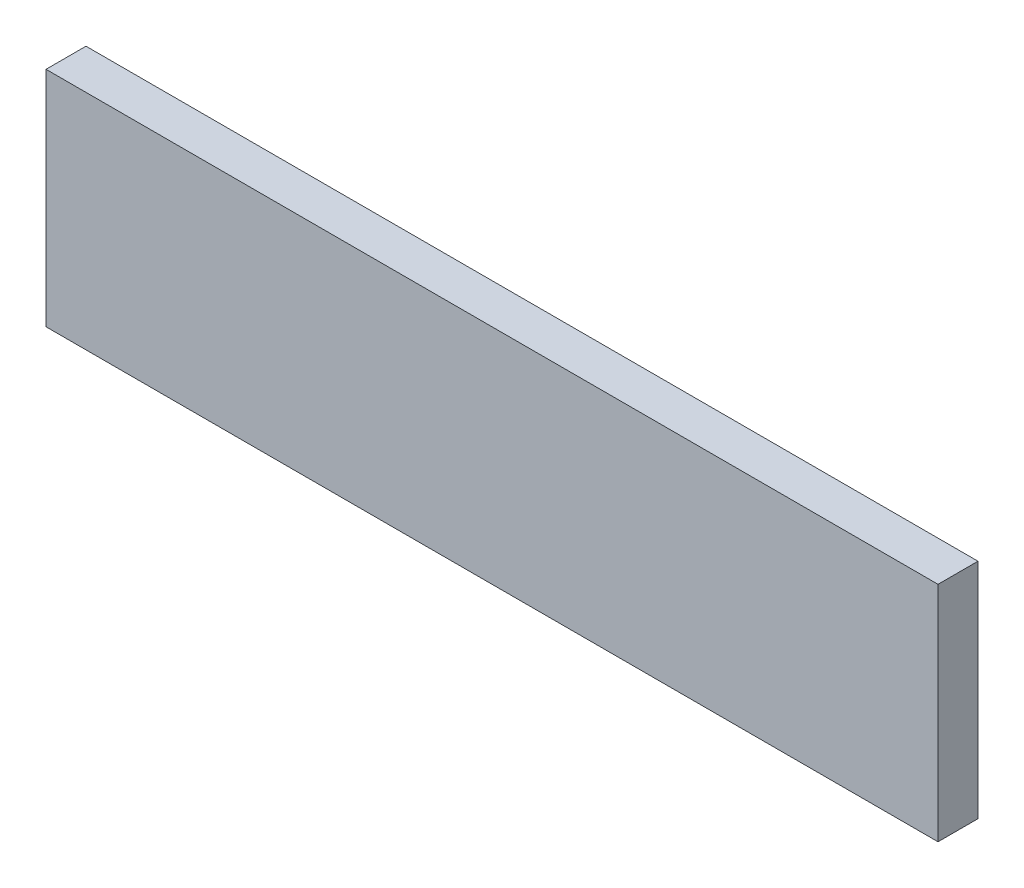
ISO-10303-21;
HEADER;
FILE_DESCRIPTION(('STEP AP214'),'2;1');
FILE_NAME('part.step','',(''),(''),'','','');
FILE_SCHEMA(('AUTOMOTIVE_DESIGN { 1 0 10303 214 1 1 1 1 }'));
ENDSEC;
DATA;
#1=APPLICATION_CONTEXT('core data for automotive mechanical design processes');
#2=APPLICATION_PROTOCOL_DEFINITION('international standard','automotive_design',2000,#1);
#3=PRODUCT_CONTEXT('',#1,'mechanical');
#4=PRODUCT('Part','Part','',(#3));
#5=PRODUCT_RELATED_PRODUCT_CATEGORY('part','',(#4));
#6=PRODUCT_DEFINITION_FORMATION('','',#4);
#7=PRODUCT_DEFINITION_CONTEXT('part definition',#1,'design');
#8=PRODUCT_DEFINITION('design','',#6,#7);
#9=PRODUCT_DEFINITION_SHAPE('','',#8);
#10=(LENGTH_UNIT() NAMED_UNIT(*) SI_UNIT(.MILLI.,.METRE.));
#11=(NAMED_UNIT(*) PLANE_ANGLE_UNIT() SI_UNIT($,.RADIAN.));
#12=(NAMED_UNIT(*) SI_UNIT($,.STERADIAN.) SOLID_ANGLE_UNIT());
#13=UNCERTAINTY_MEASURE_WITH_UNIT(LENGTH_MEASURE(1.E-05),#10,'distance_accuracy_value','');
#14=(GEOMETRIC_REPRESENTATION_CONTEXT(3) GLOBAL_UNCERTAINTY_ASSIGNED_CONTEXT((#13)) GLOBAL_UNIT_ASSIGNED_CONTEXT((#10,
#11,#12)) REPRESENTATION_CONTEXT('',''));
#15=CARTESIAN_POINT('',(0.,0.,0.));
#16=DIRECTION('',(0.,0.,1.));
#17=DIRECTION('',(1.,0.,0.));
#18=AXIS2_PLACEMENT_3D('',#15,#16,#17);
#19=CARTESIAN_POINT('',(34.,-8.5,3.048));
#20=DIRECTION('',(-1.,0.,0.));
#21=DIRECTION('',(0.,0.,1.));
#22=AXIS2_PLACEMENT_3D('',#19,#20,#21);
#23=PLANE('',#22);
#24=DIRECTION('',(0.,1.,0.));
#25=VECTOR('',#24,1.);
#26=CARTESIAN_POINT('',(34.,-8.5,0.));
#27=LINE('',#26,#25);
#28=CARTESIAN_POINT('',(34.,-8.5,0.));
#29=VERTEX_POINT('',#28);
#30=CARTESIAN_POINT('',(34.,8.5,0.));
#31=VERTEX_POINT('',#30);
#32=EDGE_CURVE('E96',#29,#31,#27,.T.);
#33=ORIENTED_EDGE('',*,*,#32,.T.);
#34=DIRECTION('',(0.,0.,-1.));
#35=VECTOR('',#34,1.);
#36=CARTESIAN_POINT('',(34.,8.5,3.048));
#37=LINE('',#36,#35);
#38=CARTESIAN_POINT('',(34.,8.5,3.048));
#39=VERTEX_POINT('',#38);
#40=EDGE_CURVE('E11',#39,#31,#37,.T.);
#41=ORIENTED_EDGE('',*,*,#40,.F.);
#42=DIRECTION('',(0.,1.,0.));
#43=VECTOR('',#42,1.);
#44=CARTESIAN_POINT('',(34.,-8.5,3.048));
#45=LINE('',#44,#43);
#46=CARTESIAN_POINT('',(34.,-8.5,3.048));
#47=VERTEX_POINT('',#46);
#48=EDGE_CURVE('E84',#47,#39,#45,.T.);
#49=ORIENTED_EDGE('',*,*,#48,.F.);
#50=DIRECTION('',(0.,0.,-1.));
#51=VECTOR('',#50,1.);
#52=CARTESIAN_POINT('',(34.,-8.5,3.048));
#53=LINE('',#52,#51);
#54=EDGE_CURVE('E92',#47,#29,#53,.T.);
#55=ORIENTED_EDGE('',*,*,#54,.T.);
#56=EDGE_LOOP('',(#33,#41,#49,#55));
#57=FACE_BOUND('',#56,.T.);
#58=ADVANCED_FACE('F33',(#57),#23,.F.);
#59=CARTESIAN_POINT('',(-34.,8.5,3.048));
#60=DIRECTION('',(0.,-1.,0.));
#61=DIRECTION('',(0.,0.,-1.));
#62=AXIS2_PLACEMENT_3D('',#59,#60,#61);
#63=PLANE('',#62);
#64=DIRECTION('',(-1.,0.,0.));
#65=VECTOR('',#64,1.);
#66=CARTESIAN_POINT('',(-34.,8.5,0.));
#67=LINE('',#66,#65);
#68=CARTESIAN_POINT('',(-34.,8.5,0.));
#69=VERTEX_POINT('',#68);
#70=EDGE_CURVE('E88',#31,#69,#67,.T.);
#71=ORIENTED_EDGE('',*,*,#70,.T.);
#72=DIRECTION('',(0.,0.,-1.));
#73=VECTOR('',#72,1.);
#74=CARTESIAN_POINT('',(-34.,8.5,3.048));
#75=LINE('',#74,#73);
#76=CARTESIAN_POINT('',(-34.,8.5,3.048));
#77=VERTEX_POINT('',#76);
#78=EDGE_CURVE('E41',#77,#69,#75,.T.);
#79=ORIENTED_EDGE('',*,*,#78,.F.);
#80=DIRECTION('',(-1.,0.,0.));
#81=VECTOR('',#80,1.);
#82=CARTESIAN_POINT('',(-34.,8.5,3.048));
#83=LINE('',#82,#81);
#84=EDGE_CURVE('E79',#39,#77,#83,.T.);
#85=ORIENTED_EDGE('',*,*,#84,.F.);
#86=ORIENTED_EDGE('',*,*,#40,.T.);
#87=EDGE_LOOP('',(#71,#79,#85,#86));
#88=FACE_BOUND('',#87,.T.);
#89=ADVANCED_FACE('F87',(#88),#63,.F.);
#90=CARTESIAN_POINT('',(-34.,-8.5,3.048));
#91=DIRECTION('',(1.,0.,0.));
#92=DIRECTION('',(0.,0.,-1.));
#93=AXIS2_PLACEMENT_3D('',#90,#91,#92);
#94=PLANE('',#93);
#95=DIRECTION('',(0.,-1.,0.));
#96=VECTOR('',#95,1.);
#97=CARTESIAN_POINT('',(-34.,-8.5,0.));
#98=LINE('',#97,#96);
#99=CARTESIAN_POINT('',(-34.,-8.5,0.));
#100=VERTEX_POINT('',#99);
#101=EDGE_CURVE('E66',#69,#100,#98,.T.);
#102=ORIENTED_EDGE('',*,*,#101,.T.);
#103=DIRECTION('',(0.,0.,-1.));
#104=VECTOR('',#103,1.);
#105=CARTESIAN_POINT('',(-34.,-8.5,3.048));
#106=LINE('',#105,#104);
#107=CARTESIAN_POINT('',(-34.,-8.5,3.048));
#108=VERTEX_POINT('',#107);
#109=EDGE_CURVE('E89',#108,#100,#106,.T.);
#110=ORIENTED_EDGE('',*,*,#109,.F.);
#111=DIRECTION('',(0.,-1.,0.));
#112=VECTOR('',#111,1.);
#113=CARTESIAN_POINT('',(-34.,-8.5,3.048));
#114=LINE('',#113,#112);
#115=EDGE_CURVE('E82',#77,#108,#114,.T.);
#116=ORIENTED_EDGE('',*,*,#115,.F.);
#117=ORIENTED_EDGE('',*,*,#78,.T.);
#118=EDGE_LOOP('',(#102,#110,#116,#117));
#119=FACE_BOUND('',#118,.T.);
#120=ADVANCED_FACE('F90',(#119),#94,.F.);
#121=CARTESIAN_POINT('',(-34.,-8.5,3.048));
#122=DIRECTION('',(0.,1.,0.));
#123=DIRECTION('',(0.,0.,1.));
#124=AXIS2_PLACEMENT_3D('',#121,#122,#123);
#125=PLANE('',#124);
#126=DIRECTION('',(1.,0.,0.));
#127=VECTOR('',#126,1.);
#128=CARTESIAN_POINT('',(-34.,-8.5,0.));
#129=LINE('',#128,#127);
#130=EDGE_CURVE('E72',#100,#29,#129,.T.);
#131=ORIENTED_EDGE('',*,*,#130,.T.);
#132=ORIENTED_EDGE('',*,*,#54,.F.);
#133=DIRECTION('',(1.,0.,0.));
#134=VECTOR('',#133,1.);
#135=CARTESIAN_POINT('',(-34.,-8.5,3.048));
#136=LINE('',#135,#134);
#137=EDGE_CURVE('E49',#108,#47,#136,.T.);
#138=ORIENTED_EDGE('',*,*,#137,.F.);
#139=ORIENTED_EDGE('',*,*,#109,.T.);
#140=EDGE_LOOP('',(#131,#132,#138,#139));
#141=FACE_BOUND('',#140,.T.);
#142=ADVANCED_FACE('F103',(#141),#125,.F.);
#143=CARTESIAN_POINT('',(0.,0.,3.048));
#144=DIRECTION('',(0.,0.,-1.));
#145=DIRECTION('',(-1.,0.,0.));
#146=AXIS2_PLACEMENT_3D('',#143,#144,#145);
#147=PLANE('',#146);
#148=ORIENTED_EDGE('',*,*,#48,.T.);
#149=ORIENTED_EDGE('',*,*,#84,.T.);
#150=ORIENTED_EDGE('',*,*,#115,.T.);
#151=ORIENTED_EDGE('',*,*,#137,.T.);
#152=EDGE_LOOP('',(#148,#149,#150,#151));
#153=FACE_BOUND('',#152,.T.);
#154=ADVANCED_FACE('F80',(#153),#147,.F.);
#155=CARTESIAN_POINT('',(0.,0.,0.));
#156=DIRECTION('',(0.,0.,-1.));
#157=DIRECTION('',(-1.,0.,0.));
#158=AXIS2_PLACEMENT_3D('',#155,#156,#157);
#159=PLANE('',#158);
#160=ORIENTED_EDGE('',*,*,#32,.F.);
#161=ORIENTED_EDGE('',*,*,#130,.F.);
#162=ORIENTED_EDGE('',*,*,#101,.F.);
#163=ORIENTED_EDGE('',*,*,#70,.F.);
#164=EDGE_LOOP('',(#160,#161,#162,#163));
#165=FACE_BOUND('',#164,.T.);
#166=ADVANCED_FACE('F106',(#165),#159,.T.);
#167=CLOSED_SHELL('',(#58,#89,#120,#142,#154,#166));
#168=MANIFOLD_SOLID_BREP('B2',#167);
#169=ADVANCED_BREP_SHAPE_REPRESENTATION('',(#18,#168),#14);
#170=SHAPE_DEFINITION_REPRESENTATION(#9,#169);
ENDSEC;
END-ISO-10303-21;
